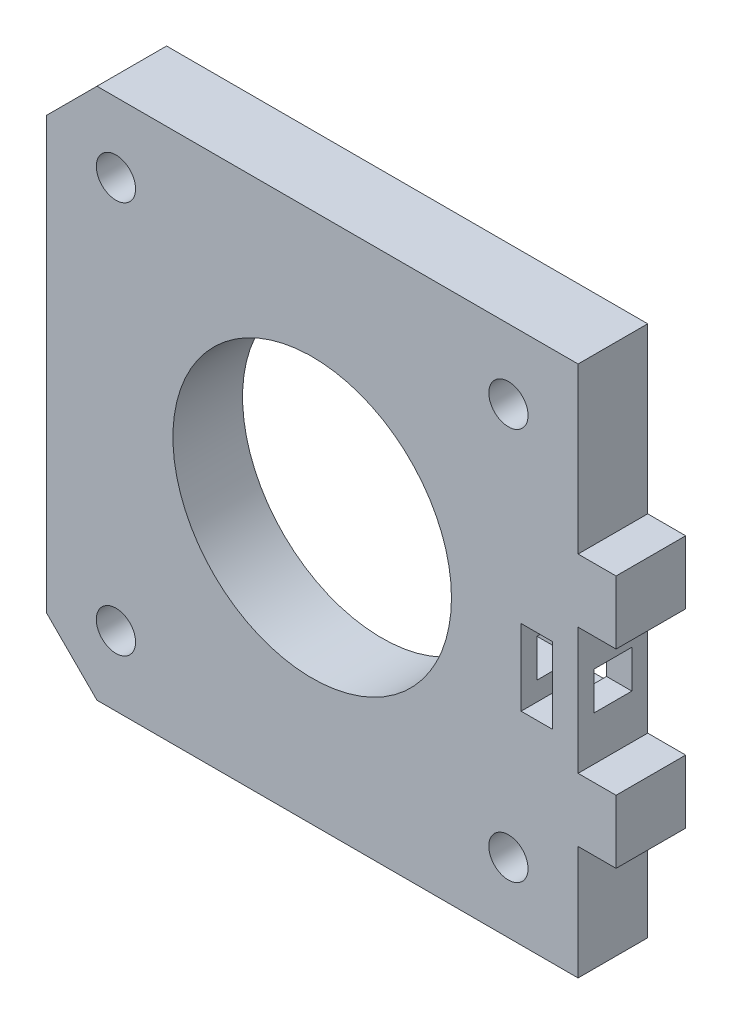
ISO-10303-21;
HEADER;
FILE_DESCRIPTION(('STEP AP214'),'2;1');
FILE_NAME('part.step','',(''),(''),'','','');
FILE_SCHEMA(('AUTOMOTIVE_DESIGN { 1 0 10303 214 1 1 1 1 }'));
ENDSEC;
DATA;
#1=APPLICATION_CONTEXT('core data for automotive mechanical design processes');
#2=APPLICATION_PROTOCOL_DEFINITION('international standard','automotive_design',2000,#1);
#3=PRODUCT_CONTEXT('',#1,'mechanical');
#4=PRODUCT('Part','Part','',(#3));
#5=PRODUCT_RELATED_PRODUCT_CATEGORY('part','',(#4));
#6=PRODUCT_DEFINITION_FORMATION('','',#4);
#7=PRODUCT_DEFINITION_CONTEXT('part definition',#1,'design');
#8=PRODUCT_DEFINITION('design','',#6,#7);
#9=PRODUCT_DEFINITION_SHAPE('','',#8);
#10=(LENGTH_UNIT() NAMED_UNIT(*) SI_UNIT(.MILLI.,.METRE.));
#11=(NAMED_UNIT(*) PLANE_ANGLE_UNIT() SI_UNIT($,.RADIAN.));
#12=(NAMED_UNIT(*) SI_UNIT($,.STERADIAN.) SOLID_ANGLE_UNIT());
#13=UNCERTAINTY_MEASURE_WITH_UNIT(LENGTH_MEASURE(1.E-05),#10,'distance_accuracy_value','');
#14=(GEOMETRIC_REPRESENTATION_CONTEXT(3) GLOBAL_UNCERTAINTY_ASSIGNED_CONTEXT((#13)) GLOBAL_UNIT_ASSIGNED_CONTEXT((#10,
#11,#12)) REPRESENTATION_CONTEXT('',''));
#15=CARTESIAN_POINT('',(0.,0.,0.));
#16=DIRECTION('',(0.,0.,1.));
#17=DIRECTION('',(1.,0.,0.));
#18=AXIS2_PLACEMENT_3D('',#15,#16,#17);
#19=CARTESIAN_POINT('',(0.,0.,5.5));
#20=DIRECTION('',(0.,0.,1.));
#21=DIRECTION('',(1.,0.,0.));
#22=AXIS2_PLACEMENT_3D('',#19,#20,#21);
#23=PLANE('',#22);
#24=CARTESIAN_POINT('',(21.,21.,5.5));
#25=DIRECTION('',(0.,0.,1.));
#26=DIRECTION('',(1.,0.,0.));
#27=AXIS2_PLACEMENT_3D('',#24,#25,#26);
#28=CIRCLE('',#27,11.);
#29=CARTESIAN_POINT('',(32.,21.,5.5));
#30=VERTEX_POINT('',#29);
#31=EDGE_CURVE('E345',#30,#30,#28,.T.);
#32=ORIENTED_EDGE('',*,*,#31,.F.);
#33=EDGE_LOOP('',(#32));
#34=FACE_BOUND('',#33,.T.);
#35=CARTESIAN_POINT('',(36.5,36.5,5.5));
#36=DIRECTION('',(0.,0.,1.));
#37=DIRECTION('',(1.,0.,0.));
#38=AXIS2_PLACEMENT_3D('',#35,#36,#37);
#39=CIRCLE('',#38,1.55);
#40=CARTESIAN_POINT('',(38.05,36.5,5.5));
#41=VERTEX_POINT('',#40);
#42=EDGE_CURVE('E348',#41,#41,#39,.T.);
#43=ORIENTED_EDGE('',*,*,#42,.F.);
#44=EDGE_LOOP('',(#43));
#45=FACE_BOUND('',#44,.T.);
#46=CARTESIAN_POINT('',(36.5,5.50000000000001,5.5));
#47=DIRECTION('',(0.,0.,1.));
#48=DIRECTION('',(1.,0.,0.));
#49=AXIS2_PLACEMENT_3D('',#46,#47,#48);
#50=CIRCLE('',#49,1.55);
#51=CARTESIAN_POINT('',(38.05,5.50000000000001,5.5));
#52=VERTEX_POINT('',#51);
#53=EDGE_CURVE('E352',#52,#52,#50,.T.);
#54=ORIENTED_EDGE('',*,*,#53,.F.);
#55=EDGE_LOOP('',(#54));
#56=FACE_BOUND('',#55,.T.);
#57=CARTESIAN_POINT('',(5.5,5.50000000000001,5.5));
#58=DIRECTION('',(0.,0.,1.));
#59=DIRECTION('',(1.,0.,0.));
#60=AXIS2_PLACEMENT_3D('',#57,#58,#59);
#61=CIRCLE('',#60,1.55);
#62=CARTESIAN_POINT('',(7.05,5.50000000000001,5.5));
#63=VERTEX_POINT('',#62);
#64=EDGE_CURVE('E355',#63,#63,#61,.T.);
#65=ORIENTED_EDGE('',*,*,#64,.F.);
#66=EDGE_LOOP('',(#65));
#67=FACE_BOUND('',#66,.T.);
#68=CARTESIAN_POINT('',(5.5,36.5,5.5));
#69=DIRECTION('',(0.,0.,1.));
#70=DIRECTION('',(1.,0.,0.));
#71=AXIS2_PLACEMENT_3D('',#68,#69,#70);
#72=CIRCLE('',#71,1.55);
#73=CARTESIAN_POINT('',(7.05,36.5,5.5));
#74=VERTEX_POINT('',#73);
#75=EDGE_CURVE('E358',#74,#74,#72,.T.);
#76=ORIENTED_EDGE('',*,*,#75,.F.);
#77=EDGE_LOOP('',(#76));
#78=FACE_BOUND('',#77,.T.);
#79=DIRECTION('',(-0.707106781186548,0.707106781186548,0.));
#80=VECTOR('',#79,1.);
#81=CARTESIAN_POINT('',(2.,2.,5.5));
#82=LINE('',#81,#80);
#83=CARTESIAN_POINT('',(4.,0.,5.5));
#84=VERTEX_POINT('',#83);
#85=CARTESIAN_POINT('',(0.,4.,5.5));
#86=VERTEX_POINT('',#85);
#87=EDGE_CURVE('E361',#84,#86,#82,.T.);
#88=ORIENTED_EDGE('',*,*,#87,.F.);
#89=DIRECTION('',(-1.,0.,0.));
#90=VECTOR('',#89,1.);
#91=CARTESIAN_POINT('',(0.,0.,5.5));
#92=LINE('',#91,#90);
#93=CARTESIAN_POINT('',(42.,0.,5.5));
#94=VERTEX_POINT('',#93);
#95=EDGE_CURVE('E364',#94,#84,#92,.T.);
#96=ORIENTED_EDGE('',*,*,#95,.F.);
#97=DIRECTION('',(0.,-1.,0.));
#98=VECTOR('',#97,1.);
#99=CARTESIAN_POINT('',(42.,0.,5.5));
#100=LINE('',#99,#98);
#101=CARTESIAN_POINT('',(42.,9.00000000000001,5.5));
#102=VERTEX_POINT('',#101);
#103=EDGE_CURVE('E367',#102,#94,#100,.T.);
#104=ORIENTED_EDGE('',*,*,#103,.F.);
#105=DIRECTION('',(-1.,0.,0.));
#106=VECTOR('',#105,1.);
#107=CARTESIAN_POINT('',(45.,9.00000000000001,5.5));
#108=LINE('',#107,#106);
#109=CARTESIAN_POINT('',(45.,9.00000000000001,5.5));
#110=VERTEX_POINT('',#109);
#111=EDGE_CURVE('E315',#110,#102,#108,.T.);
#112=ORIENTED_EDGE('',*,*,#111,.F.);
#113=DIRECTION('',(0.,-1.,0.));
#114=VECTOR('',#113,1.);
#115=CARTESIAN_POINT('',(45.,9.00000000000001,5.5));
#116=LINE('',#115,#114);
#117=CARTESIAN_POINT('',(45.,14.,5.5));
#118=VERTEX_POINT('',#117);
#119=EDGE_CURVE('E295',#118,#110,#116,.T.);
#120=ORIENTED_EDGE('',*,*,#119,.F.);
#121=DIRECTION('',(-1.,0.,0.));
#122=VECTOR('',#121,1.);
#123=CARTESIAN_POINT('',(45.,14.,5.5));
#124=LINE('',#123,#122);
#125=CARTESIAN_POINT('',(42.,14.,5.5));
#126=VERTEX_POINT('',#125);
#127=EDGE_CURVE('E305',#118,#126,#124,.T.);
#128=ORIENTED_EDGE('',*,*,#127,.T.);
#129=CARTESIAN_POINT('',(42.,24.,5.5));
#130=VERTEX_POINT('',#129);
#131=EDGE_CURVE('E371',#130,#126,#100,.T.);
#132=ORIENTED_EDGE('',*,*,#131,.F.);
#133=DIRECTION('',(-1.,0.,0.));
#134=VECTOR('',#133,1.);
#135=CARTESIAN_POINT('',(45.,24.,5.5));
#136=LINE('',#135,#134);
#137=CARTESIAN_POINT('',(45.,24.,5.5));
#138=VERTEX_POINT('',#137);
#139=EDGE_CURVE('E341',#138,#130,#136,.T.);
#140=ORIENTED_EDGE('',*,*,#139,.F.);
#141=DIRECTION('',(0.,-1.,0.));
#142=VECTOR('',#141,1.);
#143=CARTESIAN_POINT('',(45.,24.,5.5));
#144=LINE('',#143,#142);
#145=CARTESIAN_POINT('',(45.,29.,5.5));
#146=VERTEX_POINT('',#145);
#147=EDGE_CURVE('E318',#146,#138,#144,.T.);
#148=ORIENTED_EDGE('',*,*,#147,.F.);
#149=DIRECTION('',(-1.,0.,0.));
#150=VECTOR('',#149,1.);
#151=CARTESIAN_POINT('',(45.,29.,5.5));
#152=LINE('',#151,#150);
#153=CARTESIAN_POINT('',(42.,29.,5.5));
#154=VERTEX_POINT('',#153);
#155=EDGE_CURVE('E328',#146,#154,#152,.T.);
#156=ORIENTED_EDGE('',*,*,#155,.T.);
#157=CARTESIAN_POINT('',(42.,42.,5.5));
#158=VERTEX_POINT('',#157);
#159=EDGE_CURVE('E368',#158,#154,#100,.T.);
#160=ORIENTED_EDGE('',*,*,#159,.F.);
#161=DIRECTION('',(1.,0.,0.));
#162=VECTOR('',#161,1.);
#163=CARTESIAN_POINT('',(0.,42.,5.5));
#164=LINE('',#163,#162);
#165=CARTESIAN_POINT('',(4.,42.,5.5));
#166=VERTEX_POINT('',#165);
#167=EDGE_CURVE('E370',#166,#158,#164,.T.);
#168=ORIENTED_EDGE('',*,*,#167,.F.);
#169=DIRECTION('',(0.707106781186548,0.707106781186547,0.));
#170=VECTOR('',#169,1.);
#171=CARTESIAN_POINT('',(-19.,19.,5.5));
#172=LINE('',#171,#170);
#173=CARTESIAN_POINT('',(0.,38.,5.5));
#174=VERTEX_POINT('',#173);
#175=EDGE_CURVE('E374',#174,#166,#172,.T.);
#176=ORIENTED_EDGE('',*,*,#175,.F.);
#177=DIRECTION('',(0.,1.,0.));
#178=VECTOR('',#177,1.);
#179=CARTESIAN_POINT('',(0.,0.,5.5));
#180=LINE('',#179,#178);
#181=EDGE_CURVE('E377',#86,#174,#180,.T.);
#182=ORIENTED_EDGE('',*,*,#181,.F.);
#183=EDGE_LOOP('',(#88,#96,#104,#112,#120,#128,#132,#140,#148,#156,#160,#168,#176,#182));
#184=FACE_BOUND('',#183,.T.);
#185=DIRECTION('',(-1.,0.,0.));
#186=VECTOR('',#185,1.);
#187=CARTESIAN_POINT('',(0.,16.0000000000001,5.5));
#188=LINE('',#187,#186);
#189=CARTESIAN_POINT('',(40.,16.,5.5));
#190=VERTEX_POINT('',#189);
#191=CARTESIAN_POINT('',(37.5,16.,5.5));
#192=VERTEX_POINT('',#191);
#193=EDGE_CURVE('E233',#190,#192,#188,.T.);
#194=ORIENTED_EDGE('',*,*,#193,.T.);
#195=DIRECTION('',(0.,1.,0.));
#196=VECTOR('',#195,1.);
#197=CARTESIAN_POINT('',(37.5,0.,5.5));
#198=LINE('',#197,#196);
#199=CARTESIAN_POINT('',(37.5,22.,5.5));
#200=VERTEX_POINT('',#199);
#201=EDGE_CURVE('E50',#192,#200,#198,.T.);
#202=ORIENTED_EDGE('',*,*,#201,.T.);
#203=DIRECTION('',(1.,0.,0.));
#204=VECTOR('',#203,1.);
#205=CARTESIAN_POINT('',(0.,22.,5.5));
#206=LINE('',#205,#204);
#207=CARTESIAN_POINT('',(40.,22.,5.5));
#208=VERTEX_POINT('',#207);
#209=EDGE_CURVE('E224',#200,#208,#206,.T.);
#210=ORIENTED_EDGE('',*,*,#209,.T.);
#211=DIRECTION('',(0.,-1.,0.));
#212=VECTOR('',#211,1.);
#213=CARTESIAN_POINT('',(40.,0.,5.5));
#214=LINE('',#213,#212);
#215=EDGE_CURVE('E227',#208,#190,#214,.T.);
#216=ORIENTED_EDGE('',*,*,#215,.T.);
#217=EDGE_LOOP('',(#194,#202,#210,#216));
#218=FACE_BOUND('',#217,.T.);
#219=ADVANCED_FACE('F35',(#34,#45,#56,#67,#78,#184,#218),#23,.T.);
#220=CARTESIAN_POINT('',(0.,0.,0.));
#221=DIRECTION('',(0.,0.,1.));
#222=DIRECTION('',(1.,0.,0.));
#223=AXIS2_PLACEMENT_3D('',#220,#221,#222);
#224=PLANE('',#223);
#225=DIRECTION('',(-0.707106781186548,0.707106781186548,0.));
#226=VECTOR('',#225,1.);
#227=CARTESIAN_POINT('',(2.,2.,0.));
#228=LINE('',#227,#226);
#229=CARTESIAN_POINT('',(4.,0.,0.));
#230=VERTEX_POINT('',#229);
#231=CARTESIAN_POINT('',(0.,4.,0.));
#232=VERTEX_POINT('',#231);
#233=EDGE_CURVE('E395',#230,#232,#228,.T.);
#234=ORIENTED_EDGE('',*,*,#233,.T.);
#235=DIRECTION('',(0.,1.,0.));
#236=VECTOR('',#235,1.);
#237=CARTESIAN_POINT('',(0.,0.,0.));
#238=LINE('',#237,#236);
#239=CARTESIAN_POINT('',(0.,38.,0.));
#240=VERTEX_POINT('',#239);
#241=EDGE_CURVE('E349',#232,#240,#238,.T.);
#242=ORIENTED_EDGE('',*,*,#241,.T.);
#243=DIRECTION('',(0.707106781186548,0.707106781186547,0.));
#244=VECTOR('',#243,1.);
#245=CARTESIAN_POINT('',(-19.,19.,0.));
#246=LINE('',#245,#244);
#247=CARTESIAN_POINT('',(4.,42.,0.));
#248=VERTEX_POINT('',#247);
#249=EDGE_CURVE('E409',#240,#248,#246,.T.);
#250=ORIENTED_EDGE('',*,*,#249,.T.);
#251=DIRECTION('',(1.,0.,0.));
#252=VECTOR('',#251,1.);
#253=CARTESIAN_POINT('',(0.,42.,0.));
#254=LINE('',#253,#252);
#255=CARTESIAN_POINT('',(42.,42.,0.));
#256=VERTEX_POINT('',#255);
#257=EDGE_CURVE('E405',#248,#256,#254,.T.);
#258=ORIENTED_EDGE('',*,*,#257,.T.);
#259=DIRECTION('',(0.,-1.,0.));
#260=VECTOR('',#259,1.);
#261=CARTESIAN_POINT('',(42.,0.,0.));
#262=LINE('',#261,#260);
#263=CARTESIAN_POINT('',(42.,29.,0.));
#264=VERTEX_POINT('',#263);
#265=EDGE_CURVE('E402',#256,#264,#262,.T.);
#266=ORIENTED_EDGE('',*,*,#265,.T.);
#267=DIRECTION('',(-1.,0.,0.));
#268=VECTOR('',#267,1.);
#269=CARTESIAN_POINT('',(45.,29.,0.));
#270=LINE('',#269,#268);
#271=CARTESIAN_POINT('',(45.,29.,0.));
#272=VERTEX_POINT('',#271);
#273=EDGE_CURVE('E335',#272,#264,#270,.T.);
#274=ORIENTED_EDGE('',*,*,#273,.F.);
#275=DIRECTION('',(0.,1.,0.));
#276=VECTOR('',#275,1.);
#277=CARTESIAN_POINT('',(45.,29.,0.));
#278=LINE('',#277,#276);
#279=CARTESIAN_POINT('',(45.,24.,0.));
#280=VERTEX_POINT('',#279);
#281=EDGE_CURVE('E324',#280,#272,#278,.T.);
#282=ORIENTED_EDGE('',*,*,#281,.F.);
#283=DIRECTION('',(-1.,0.,0.));
#284=VECTOR('',#283,1.);
#285=CARTESIAN_POINT('',(45.,24.,0.));
#286=LINE('',#285,#284);
#287=CARTESIAN_POINT('',(42.,24.,0.));
#288=VERTEX_POINT('',#287);
#289=EDGE_CURVE('E338',#280,#288,#286,.T.);
#290=ORIENTED_EDGE('',*,*,#289,.T.);
#291=CARTESIAN_POINT('',(42.,14.,0.));
#292=VERTEX_POINT('',#291);
#293=EDGE_CURVE('E406',#288,#292,#262,.T.);
#294=ORIENTED_EDGE('',*,*,#293,.T.);
#295=DIRECTION('',(-1.,0.,0.));
#296=VECTOR('',#295,1.);
#297=CARTESIAN_POINT('',(45.,14.,0.));
#298=LINE('',#297,#296);
#299=CARTESIAN_POINT('',(45.,14.,0.));
#300=VERTEX_POINT('',#299);
#301=EDGE_CURVE('E311',#300,#292,#298,.T.);
#302=ORIENTED_EDGE('',*,*,#301,.F.);
#303=DIRECTION('',(0.,1.,0.));
#304=VECTOR('',#303,1.);
#305=CARTESIAN_POINT('',(45.,14.,0.));
#306=LINE('',#305,#304);
#307=CARTESIAN_POINT('',(45.,9.00000000000001,0.));
#308=VERTEX_POINT('',#307);
#309=EDGE_CURVE('E301',#308,#300,#306,.T.);
#310=ORIENTED_EDGE('',*,*,#309,.F.);
#311=DIRECTION('',(-1.,0.,0.));
#312=VECTOR('',#311,1.);
#313=CARTESIAN_POINT('',(45.,9.00000000000001,0.));
#314=LINE('',#313,#312);
#315=CARTESIAN_POINT('',(42.,9.00000000000001,0.));
#316=VERTEX_POINT('',#315);
#317=EDGE_CURVE('E313',#308,#316,#314,.T.);
#318=ORIENTED_EDGE('',*,*,#317,.T.);
#319=CARTESIAN_POINT('',(42.,0.,0.));
#320=VERTEX_POINT('',#319);
#321=EDGE_CURVE('E401',#316,#320,#262,.T.);
#322=ORIENTED_EDGE('',*,*,#321,.T.);
#323=DIRECTION('',(-1.,0.,0.));
#324=VECTOR('',#323,1.);
#325=CARTESIAN_POINT('',(0.,0.,0.));
#326=LINE('',#325,#324);
#327=EDGE_CURVE('E398',#320,#230,#326,.T.);
#328=ORIENTED_EDGE('',*,*,#327,.T.);
#329=EDGE_LOOP('',(#234,#242,#250,#258,#266,#274,#282,#290,#294,#302,#310,#318,#322,#328));
#330=FACE_BOUND('',#329,.T.);
#331=CARTESIAN_POINT('',(5.5,36.5,0.));
#332=DIRECTION('',(0.,0.,1.));
#333=DIRECTION('',(1.,0.,0.));
#334=AXIS2_PLACEMENT_3D('',#331,#332,#333);
#335=CIRCLE('',#334,1.55);
#336=CARTESIAN_POINT('',(7.05,36.5,0.));
#337=VERTEX_POINT('',#336);
#338=EDGE_CURVE('E392',#337,#337,#335,.T.);
#339=ORIENTED_EDGE('',*,*,#338,.T.);
#340=EDGE_LOOP('',(#339));
#341=FACE_BOUND('',#340,.T.);
#342=CARTESIAN_POINT('',(5.5,5.50000000000001,0.));
#343=DIRECTION('',(0.,0.,1.));
#344=DIRECTION('',(1.,0.,0.));
#345=AXIS2_PLACEMENT_3D('',#342,#343,#344);
#346=CIRCLE('',#345,1.55);
#347=CARTESIAN_POINT('',(7.05,5.50000000000001,0.));
#348=VERTEX_POINT('',#347);
#349=EDGE_CURVE('E389',#348,#348,#346,.T.);
#350=ORIENTED_EDGE('',*,*,#349,.T.);
#351=EDGE_LOOP('',(#350));
#352=FACE_BOUND('',#351,.T.);
#353=CARTESIAN_POINT('',(36.5,5.50000000000001,0.));
#354=DIRECTION('',(0.,0.,1.));
#355=DIRECTION('',(1.,0.,0.));
#356=AXIS2_PLACEMENT_3D('',#353,#354,#355);
#357=CIRCLE('',#356,1.55);
#358=CARTESIAN_POINT('',(38.05,5.50000000000001,0.));
#359=VERTEX_POINT('',#358);
#360=EDGE_CURVE('E386',#359,#359,#357,.T.);
#361=ORIENTED_EDGE('',*,*,#360,.T.);
#362=EDGE_LOOP('',(#361));
#363=FACE_BOUND('',#362,.T.);
#364=CARTESIAN_POINT('',(36.5,36.5,0.));
#365=DIRECTION('',(0.,0.,1.));
#366=DIRECTION('',(1.,0.,0.));
#367=AXIS2_PLACEMENT_3D('',#364,#365,#366);
#368=CIRCLE('',#367,1.55);
#369=CARTESIAN_POINT('',(38.05,36.5,0.));
#370=VERTEX_POINT('',#369);
#371=EDGE_CURVE('E383',#370,#370,#368,.T.);
#372=ORIENTED_EDGE('',*,*,#371,.T.);
#373=EDGE_LOOP('',(#372));
#374=FACE_BOUND('',#373,.T.);
#375=CARTESIAN_POINT('',(21.,21.,0.));
#376=DIRECTION('',(0.,0.,1.));
#377=DIRECTION('',(1.,0.,0.));
#378=AXIS2_PLACEMENT_3D('',#375,#376,#377);
#379=CIRCLE('',#378,11.);
#380=CARTESIAN_POINT('',(32.,21.,0.));
#381=VERTEX_POINT('',#380);
#382=EDGE_CURVE('E344',#381,#381,#379,.T.);
#383=ORIENTED_EDGE('',*,*,#382,.T.);
#384=EDGE_LOOP('',(#383));
#385=FACE_BOUND('',#384,.T.);
#386=DIRECTION('',(0.,1.,0.));
#387=VECTOR('',#386,1.);
#388=CARTESIAN_POINT('',(37.5,0.,0.));
#389=LINE('',#388,#387);
#390=CARTESIAN_POINT('',(37.5,16.,0.));
#391=VERTEX_POINT('',#390);
#392=CARTESIAN_POINT('',(37.5,22.,0.));
#393=VERTEX_POINT('',#392);
#394=EDGE_CURVE('E215',#391,#393,#389,.T.);
#395=ORIENTED_EDGE('',*,*,#394,.F.);
#396=DIRECTION('',(-1.,0.,0.));
#397=VECTOR('',#396,1.);
#398=CARTESIAN_POINT('',(0.,16.0000000000001,0.));
#399=LINE('',#398,#397);
#400=CARTESIAN_POINT('',(40.,16.,0.));
#401=VERTEX_POINT('',#400);
#402=EDGE_CURVE('E207',#401,#391,#399,.T.);
#403=ORIENTED_EDGE('',*,*,#402,.F.);
#404=DIRECTION('',(0.,-1.,0.));
#405=VECTOR('',#404,1.);
#406=CARTESIAN_POINT('',(40.,0.,0.));
#407=LINE('',#406,#405);
#408=CARTESIAN_POINT('',(40.,22.,0.));
#409=VERTEX_POINT('',#408);
#410=EDGE_CURVE('E214',#409,#401,#407,.T.);
#411=ORIENTED_EDGE('',*,*,#410,.F.);
#412=DIRECTION('',(1.,0.,0.));
#413=VECTOR('',#412,1.);
#414=CARTESIAN_POINT('',(0.,22.,0.));
#415=LINE('',#414,#413);
#416=EDGE_CURVE('E220',#393,#409,#415,.T.);
#417=ORIENTED_EDGE('',*,*,#416,.F.);
#418=EDGE_LOOP('',(#395,#403,#411,#417));
#419=FACE_BOUND('',#418,.T.);
#420=ADVANCED_FACE('F223',(#330,#341,#352,#363,#374,#385,#419),#224,.F.);
#421=CARTESIAN_POINT('',(34.,20.5,1.25));
#422=DIRECTION('',(0.,0.,-1.));
#423=DIRECTION('',(0.,1.,0.));
#424=AXIS2_PLACEMENT_3D('',#421,#422,#423);
#425=PLANE('',#424);
#426=DIRECTION('',(0.,1.,0.));
#427=VECTOR('',#426,1.);
#428=CARTESIAN_POINT('',(40.,20.5,1.25));
#429=LINE('',#428,#427);
#430=CARTESIAN_POINT('',(40.,17.5,1.25));
#431=VERTEX_POINT('',#430);
#432=CARTESIAN_POINT('',(40.,20.5,1.25));
#433=VERTEX_POINT('',#432);
#434=EDGE_CURVE('E246',#431,#433,#429,.T.);
#435=ORIENTED_EDGE('',*,*,#434,.F.);
#436=DIRECTION('',(1.,0.,0.));
#437=VECTOR('',#436,1.);
#438=CARTESIAN_POINT('',(34.,17.5,1.25));
#439=LINE('',#438,#437);
#440=CARTESIAN_POINT('',(42.,17.5,1.25));
#441=VERTEX_POINT('',#440);
#442=EDGE_CURVE('E283',#431,#441,#439,.T.);
#443=ORIENTED_EDGE('',*,*,#442,.T.);
#444=DIRECTION('',(0.,1.,0.));
#445=VECTOR('',#444,1.);
#446=CARTESIAN_POINT('',(42.,20.5,1.25));
#447=LINE('',#446,#445);
#448=CARTESIAN_POINT('',(42.,20.5,1.25));
#449=VERTEX_POINT('',#448);
#450=EDGE_CURVE('E254',#441,#449,#447,.T.);
#451=ORIENTED_EDGE('',*,*,#450,.T.);
#452=DIRECTION('',(1.,0.,0.));
#453=VECTOR('',#452,1.);
#454=CARTESIAN_POINT('',(34.,20.5,1.25));
#455=LINE('',#454,#453);
#456=EDGE_CURVE('E268',#433,#449,#455,.T.);
#457=ORIENTED_EDGE('',*,*,#456,.F.);
#458=EDGE_LOOP('',(#435,#443,#451,#457));
#459=FACE_BOUND('',#458,.T.);
#460=ADVANCED_FACE('F449',(#459),#425,.F.);
#461=CARTESIAN_POINT('',(34.,17.5,4.25));
#462=DIRECTION('',(0.,-1.,0.));
#463=DIRECTION('',(1.,0.,0.));
#464=AXIS2_PLACEMENT_3D('',#461,#462,#463);
#465=PLANE('',#464);
#466=DIRECTION('',(0.,0.,-1.));
#467=VECTOR('',#466,1.);
#468=CARTESIAN_POINT('',(40.,17.5,4.25));
#469=LINE('',#468,#467);
#470=CARTESIAN_POINT('',(40.,17.5,4.25));
#471=VERTEX_POINT('',#470);
#472=EDGE_CURVE('E244',#471,#431,#469,.T.);
#473=ORIENTED_EDGE('',*,*,#472,.F.);
#474=DIRECTION('',(1.,0.,0.));
#475=VECTOR('',#474,1.);
#476=CARTESIAN_POINT('',(34.,17.5,4.25));
#477=LINE('',#476,#475);
#478=CARTESIAN_POINT('',(42.,17.5,4.25));
#479=VERTEX_POINT('',#478);
#480=EDGE_CURVE('E287',#471,#479,#477,.T.);
#481=ORIENTED_EDGE('',*,*,#480,.T.);
#482=DIRECTION('',(0.,0.,-1.));
#483=VECTOR('',#482,1.);
#484=CARTESIAN_POINT('',(42.,17.5,4.25));
#485=LINE('',#484,#483);
#486=EDGE_CURVE('E259',#479,#441,#485,.T.);
#487=ORIENTED_EDGE('',*,*,#486,.T.);
#488=ORIENTED_EDGE('',*,*,#442,.F.);
#489=EDGE_LOOP('',(#473,#481,#487,#488));
#490=FACE_BOUND('',#489,.T.);
#491=ADVANCED_FACE('F447',(#490),#465,.F.);
#492=CARTESIAN_POINT('',(34.,20.5,4.25));
#493=DIRECTION('',(0.,0.,1.));
#494=DIRECTION('',(1.,0.,0.));
#495=AXIS2_PLACEMENT_3D('',#492,#493,#494);
#496=PLANE('',#495);
#497=DIRECTION('',(0.,-1.,0.));
#498=VECTOR('',#497,1.);
#499=CARTESIAN_POINT('',(40.,20.5,4.25));
#500=LINE('',#499,#498);
#501=CARTESIAN_POINT('',(40.,20.5,4.25));
#502=VERTEX_POINT('',#501);
#503=EDGE_CURVE('E239',#502,#471,#500,.T.);
#504=ORIENTED_EDGE('',*,*,#503,.F.);
#505=DIRECTION('',(1.,0.,0.));
#506=VECTOR('',#505,1.);
#507=CARTESIAN_POINT('',(34.,20.5,4.25));
#508=LINE('',#507,#506);
#509=CARTESIAN_POINT('',(42.,20.5,4.25));
#510=VERTEX_POINT('',#509);
#511=EDGE_CURVE('E291',#502,#510,#508,.T.);
#512=ORIENTED_EDGE('',*,*,#511,.T.);
#513=DIRECTION('',(0.,-1.,0.));
#514=VECTOR('',#513,1.);
#515=CARTESIAN_POINT('',(42.,20.5,4.25));
#516=LINE('',#515,#514);
#517=EDGE_CURVE('E274',#510,#479,#516,.T.);
#518=ORIENTED_EDGE('',*,*,#517,.T.);
#519=ORIENTED_EDGE('',*,*,#480,.F.);
#520=EDGE_LOOP('',(#504,#512,#518,#519));
#521=FACE_BOUND('',#520,.T.);
#522=ADVANCED_FACE('F436',(#521),#496,.F.);
#523=CARTESIAN_POINT('',(34.,20.5,4.25));
#524=DIRECTION('',(0.,1.,0.));
#525=DIRECTION('',(-1.,0.,0.));
#526=AXIS2_PLACEMENT_3D('',#523,#524,#525);
#527=PLANE('',#526);
#528=DIRECTION('',(0.,0.,1.));
#529=VECTOR('',#528,1.);
#530=CARTESIAN_POINT('',(40.,20.5,4.25));
#531=LINE('',#530,#529);
#532=EDGE_CURVE('E43',#433,#502,#531,.T.);
#533=ORIENTED_EDGE('',*,*,#532,.F.);
#534=ORIENTED_EDGE('',*,*,#456,.T.);
#535=DIRECTION('',(0.,0.,1.));
#536=VECTOR('',#535,1.);
#537=CARTESIAN_POINT('',(42.,20.5,4.25));
#538=LINE('',#537,#536);
#539=EDGE_CURVE('E271',#449,#510,#538,.T.);
#540=ORIENTED_EDGE('',*,*,#539,.T.);
#541=ORIENTED_EDGE('',*,*,#511,.F.);
#542=EDGE_LOOP('',(#533,#534,#540,#541));
#543=FACE_BOUND('',#542,.T.);
#544=ADVANCED_FACE('F437',(#543),#527,.F.);
#545=CARTESIAN_POINT('',(42.,0.,5.5));
#546=DIRECTION('',(1.,0.,0.));
#547=DIRECTION('',(0.,1.,0.));
#548=AXIS2_PLACEMENT_3D('',#545,#546,#547);
#549=PLANE('',#548);
#550=ORIENTED_EDGE('',*,*,#321,.F.);
#551=DIRECTION('',(0.,0.,-1.));
#552=VECTOR('',#551,1.);
#553=CARTESIAN_POINT('',(42.,9.00000000000001,0.));
#554=LINE('',#553,#552);
#555=EDGE_CURVE('E282',#102,#316,#554,.T.);
#556=ORIENTED_EDGE('',*,*,#555,.F.);
#557=ORIENTED_EDGE('',*,*,#103,.T.);
#558=DIRECTION('',(0.,0.,-1.));
#559=VECTOR('',#558,1.);
#560=CARTESIAN_POINT('',(42.,0.,5.5));
#561=LINE('',#560,#559);
#562=EDGE_CURVE('E421',#94,#320,#561,.T.);
#563=ORIENTED_EDGE('',*,*,#562,.T.);
#564=EDGE_LOOP('',(#550,#556,#557,#563));
#565=FACE_BOUND('',#564,.T.);
#566=ADVANCED_FACE('F490',(#565),#549,.T.);
#567=ORIENTED_EDGE('',*,*,#450,.F.);
#568=ORIENTED_EDGE('',*,*,#486,.F.);
#569=ORIENTED_EDGE('',*,*,#517,.F.);
#570=ORIENTED_EDGE('',*,*,#539,.F.);
#571=EDGE_LOOP('',(#567,#568,#569,#570));
#572=FACE_BOUND('',#571,.T.);
#573=ORIENTED_EDGE('',*,*,#131,.T.);
#574=DIRECTION('',(0.,0.,1.));
#575=VECTOR('',#574,1.);
#576=CARTESIAN_POINT('',(42.,14.,5.5));
#577=LINE('',#576,#575);
#578=EDGE_CURVE('E299',#292,#126,#577,.T.);
#579=ORIENTED_EDGE('',*,*,#578,.F.);
#580=ORIENTED_EDGE('',*,*,#293,.F.);
#581=DIRECTION('',(0.,0.,-1.));
#582=VECTOR('',#581,1.);
#583=CARTESIAN_POINT('',(42.,24.,0.));
#584=LINE('',#583,#582);
#585=EDGE_CURVE('E317',#130,#288,#584,.T.);
#586=ORIENTED_EDGE('',*,*,#585,.F.);
#587=EDGE_LOOP('',(#573,#579,#580,#586));
#588=FACE_BOUND('',#587,.T.);
#589=ADVANCED_FACE('F443',(#572,#588),#549,.T.);
#590=DIRECTION('',(0.,0.,1.));
#591=VECTOR('',#590,1.);
#592=CARTESIAN_POINT('',(42.,29.,5.5));
#593=LINE('',#592,#591);
#594=EDGE_CURVE('E322',#264,#154,#593,.T.);
#595=ORIENTED_EDGE('',*,*,#594,.F.);
#596=ORIENTED_EDGE('',*,*,#265,.F.);
#597=DIRECTION('',(0.,0.,-1.));
#598=VECTOR('',#597,1.);
#599=CARTESIAN_POINT('',(42.,42.,5.5));
#600=LINE('',#599,#598);
#601=EDGE_CURVE('E419',#158,#256,#600,.T.);
#602=ORIENTED_EDGE('',*,*,#601,.F.);
#603=ORIENTED_EDGE('',*,*,#159,.T.);
#604=EDGE_LOOP('',(#595,#596,#602,#603));
#605=FACE_BOUND('',#604,.T.);
#606=ADVANCED_FACE('F494',(#605),#549,.T.);
#607=CARTESIAN_POINT('',(2.,2.,5.5));
#608=DIRECTION('',(-0.707106781186548,-0.707106781186548,0.));
#609=DIRECTION('',(0.707106781186548,-0.707106781186548,0.));
#610=AXIS2_PLACEMENT_3D('',#607,#608,#609);
#611=PLANE('',#610);
#612=ORIENTED_EDGE('',*,*,#233,.F.);
#613=DIRECTION('',(0.,0.,-1.));
#614=VECTOR('',#613,1.);
#615=CARTESIAN_POINT('',(4.,0.,5.5));
#616=LINE('',#615,#614);
#617=EDGE_CURVE('E424',#84,#230,#616,.T.);
#618=ORIENTED_EDGE('',*,*,#617,.F.);
#619=ORIENTED_EDGE('',*,*,#87,.T.);
#620=DIRECTION('',(0.,0.,-1.));
#621=VECTOR('',#620,1.);
#622=CARTESIAN_POINT('',(0.,4.,5.5));
#623=LINE('',#622,#621);
#624=EDGE_CURVE('E380',#86,#232,#623,.T.);
#625=ORIENTED_EDGE('',*,*,#624,.T.);
#626=EDGE_LOOP('',(#612,#618,#619,#625));
#627=FACE_BOUND('',#626,.T.);
#628=ADVANCED_FACE('F497',(#627),#611,.T.);
#629=CARTESIAN_POINT('',(0.,0.,5.5));
#630=DIRECTION('',(0.,-1.,0.));
#631=DIRECTION('',(1.,0.,0.));
#632=AXIS2_PLACEMENT_3D('',#629,#630,#631);
#633=PLANE('',#632);
#634=ORIENTED_EDGE('',*,*,#327,.F.);
#635=ORIENTED_EDGE('',*,*,#562,.F.);
#636=ORIENTED_EDGE('',*,*,#95,.T.);
#637=ORIENTED_EDGE('',*,*,#617,.T.);
#638=EDGE_LOOP('',(#634,#635,#636,#637));
#639=FACE_BOUND('',#638,.T.);
#640=ADVANCED_FACE('F488',(#639),#633,.T.);
#641=CARTESIAN_POINT('',(0.,42.,5.5));
#642=DIRECTION('',(0.,1.,0.));
#643=DIRECTION('',(-1.,0.,0.));
#644=AXIS2_PLACEMENT_3D('',#641,#642,#643);
#645=PLANE('',#644);
#646=ORIENTED_EDGE('',*,*,#257,.F.);
#647=DIRECTION('',(0.,0.,-1.));
#648=VECTOR('',#647,1.);
#649=CARTESIAN_POINT('',(4.,42.,5.5));
#650=LINE('',#649,#648);
#651=EDGE_CURVE('E417',#166,#248,#650,.T.);
#652=ORIENTED_EDGE('',*,*,#651,.F.);
#653=ORIENTED_EDGE('',*,*,#167,.T.);
#654=ORIENTED_EDGE('',*,*,#601,.T.);
#655=EDGE_LOOP('',(#646,#652,#653,#654));
#656=FACE_BOUND('',#655,.T.);
#657=ADVANCED_FACE('F484',(#656),#645,.T.);
#658=CARTESIAN_POINT('',(-19.,19.,5.5));
#659=DIRECTION('',(-0.707106781186547,0.707106781186548,0.));
#660=DIRECTION('',(-0.707106781186548,-0.707106781186547,0.));
#661=AXIS2_PLACEMENT_3D('',#658,#659,#660);
#662=PLANE('',#661);
#663=ORIENTED_EDGE('',*,*,#249,.F.);
#664=DIRECTION('',(0.,0.,-1.));
#665=VECTOR('',#664,1.);
#666=CARTESIAN_POINT('',(0.,38.,5.5));
#667=LINE('',#666,#665);
#668=EDGE_CURVE('E415',#174,#240,#667,.T.);
#669=ORIENTED_EDGE('',*,*,#668,.F.);
#670=ORIENTED_EDGE('',*,*,#175,.T.);
#671=ORIENTED_EDGE('',*,*,#651,.T.);
#672=EDGE_LOOP('',(#663,#669,#670,#671));
#673=FACE_BOUND('',#672,.T.);
#674=ADVANCED_FACE('F480',(#673),#662,.T.);
#675=CARTESIAN_POINT('',(5.5,36.5,5.5));
#676=DIRECTION('',(0.,0.,-1.));
#677=DIRECTION('',(-1.,0.,0.));
#678=AXIS2_PLACEMENT_3D('',#675,#676,#677);
#679=CYLINDRICAL_SURFACE('',#678,1.55);
#680=ORIENTED_EDGE('',*,*,#75,.T.);
#681=EDGE_LOOP('',(#680));
#682=FACE_BOUND('',#681,.T.);
#683=ORIENTED_EDGE('',*,*,#338,.F.);
#684=EDGE_LOOP('',(#683));
#685=FACE_BOUND('',#684,.T.);
#686=ADVANCED_FACE('F483',(#682,#685),#679,.F.);
#687=CARTESIAN_POINT('',(5.5,5.50000000000001,5.5));
#688=DIRECTION('',(0.,0.,-1.));
#689=DIRECTION('',(-1.,0.,0.));
#690=AXIS2_PLACEMENT_3D('',#687,#688,#689);
#691=CYLINDRICAL_SURFACE('',#690,1.55);
#692=ORIENTED_EDGE('',*,*,#64,.T.);
#693=EDGE_LOOP('',(#692));
#694=FACE_BOUND('',#693,.T.);
#695=ORIENTED_EDGE('',*,*,#349,.F.);
#696=EDGE_LOOP('',(#695));
#697=FACE_BOUND('',#696,.T.);
#698=ADVANCED_FACE('F504',(#694,#697),#691,.F.);
#699=CARTESIAN_POINT('',(36.5,5.50000000000001,5.5));
#700=DIRECTION('',(0.,0.,-1.));
#701=DIRECTION('',(-1.,0.,0.));
#702=AXIS2_PLACEMENT_3D('',#699,#700,#701);
#703=CYLINDRICAL_SURFACE('',#702,1.55);
#704=ORIENTED_EDGE('',*,*,#53,.T.);
#705=EDGE_LOOP('',(#704));
#706=FACE_BOUND('',#705,.T.);
#707=ORIENTED_EDGE('',*,*,#360,.F.);
#708=EDGE_LOOP('',(#707));
#709=FACE_BOUND('',#708,.T.);
#710=ADVANCED_FACE('F508',(#706,#709),#703,.F.);
#711=CARTESIAN_POINT('',(36.5,36.5,5.5));
#712=DIRECTION('',(0.,0.,-1.));
#713=DIRECTION('',(-1.,0.,0.));
#714=AXIS2_PLACEMENT_3D('',#711,#712,#713);
#715=CYLINDRICAL_SURFACE('',#714,1.55);
#716=ORIENTED_EDGE('',*,*,#42,.T.);
#717=EDGE_LOOP('',(#716));
#718=FACE_BOUND('',#717,.T.);
#719=ORIENTED_EDGE('',*,*,#371,.F.);
#720=EDGE_LOOP('',(#719));
#721=FACE_BOUND('',#720,.T.);
#722=ADVANCED_FACE('F511',(#718,#721),#715,.F.);
#723=CARTESIAN_POINT('',(21.,21.,5.5));
#724=DIRECTION('',(0.,0.,-1.));
#725=DIRECTION('',(-1.,0.,0.));
#726=AXIS2_PLACEMENT_3D('',#723,#724,#725);
#727=CYLINDRICAL_SURFACE('',#726,11.);
#728=ORIENTED_EDGE('',*,*,#31,.T.);
#729=EDGE_LOOP('',(#728));
#730=FACE_BOUND('',#729,.T.);
#731=ORIENTED_EDGE('',*,*,#382,.F.);
#732=EDGE_LOOP('',(#731));
#733=FACE_BOUND('',#732,.T.);
#734=ADVANCED_FACE('F37',(#730,#733),#727,.F.);
#735=CARTESIAN_POINT('',(0.,0.,5.5));
#736=DIRECTION('',(-1.,0.,0.));
#737=DIRECTION('',(0.,0.,1.));
#738=AXIS2_PLACEMENT_3D('',#735,#736,#737);
#739=PLANE('',#738);
#740=ORIENTED_EDGE('',*,*,#241,.F.);
#741=ORIENTED_EDGE('',*,*,#624,.F.);
#742=ORIENTED_EDGE('',*,*,#181,.T.);
#743=ORIENTED_EDGE('',*,*,#668,.T.);
#744=EDGE_LOOP('',(#740,#741,#742,#743));
#745=FACE_BOUND('',#744,.T.);
#746=ADVANCED_FACE('F476',(#745),#739,.T.);
#747=CARTESIAN_POINT('',(45.,24.,0.));
#748=DIRECTION('',(0.,1.,0.));
#749=DIRECTION('',(-1.,0.,0.));
#750=AXIS2_PLACEMENT_3D('',#747,#748,#749);
#751=PLANE('',#750);
#752=ORIENTED_EDGE('',*,*,#585,.T.);
#753=ORIENTED_EDGE('',*,*,#289,.F.);
#754=DIRECTION('',(0.,0.,-1.));
#755=VECTOR('',#754,1.);
#756=CARTESIAN_POINT('',(45.,24.,0.));
#757=LINE('',#756,#755);
#758=EDGE_CURVE('E321',#138,#280,#757,.T.);
#759=ORIENTED_EDGE('',*,*,#758,.F.);
#760=ORIENTED_EDGE('',*,*,#139,.T.);
#761=EDGE_LOOP('',(#752,#753,#759,#760));
#762=FACE_BOUND('',#761,.T.);
#763=ADVANCED_FACE('F473',(#762),#751,.F.);
#764=CARTESIAN_POINT('',(45.,29.,5.5));
#765=DIRECTION('',(0.,-1.,0.));
#766=DIRECTION('',(1.,0.,0.));
#767=AXIS2_PLACEMENT_3D('',#764,#765,#766);
#768=PLANE('',#767);
#769=ORIENTED_EDGE('',*,*,#594,.T.);
#770=ORIENTED_EDGE('',*,*,#155,.F.);
#771=DIRECTION('',(0.,0.,1.));
#772=VECTOR('',#771,1.);
#773=CARTESIAN_POINT('',(45.,29.,5.5));
#774=LINE('',#773,#772);
#775=EDGE_CURVE('E326',#272,#146,#774,.T.);
#776=ORIENTED_EDGE('',*,*,#775,.F.);
#777=ORIENTED_EDGE('',*,*,#273,.T.);
#778=EDGE_LOOP('',(#769,#770,#776,#777));
#779=FACE_BOUND('',#778,.T.);
#780=ADVANCED_FACE('F655',(#779),#768,.F.);
#781=CARTESIAN_POINT('',(45.,0.,0.));
#782=DIRECTION('',(-1.,0.,0.));
#783=DIRECTION('',(0.,0.,1.));
#784=AXIS2_PLACEMENT_3D('',#781,#782,#783);
#785=PLANE('',#784);
#786=ORIENTED_EDGE('',*,*,#147,.T.);
#787=ORIENTED_EDGE('',*,*,#758,.T.);
#788=ORIENTED_EDGE('',*,*,#281,.T.);
#789=ORIENTED_EDGE('',*,*,#775,.T.);
#790=EDGE_LOOP('',(#786,#787,#788,#789));
#791=FACE_BOUND('',#790,.T.);
#792=ADVANCED_FACE('F645',(#791),#785,.F.);
#793=CARTESIAN_POINT('',(45.,9.00000000000001,0.));
#794=DIRECTION('',(0.,1.,0.));
#795=DIRECTION('',(-1.,0.,0.));
#796=AXIS2_PLACEMENT_3D('',#793,#794,#795);
#797=PLANE('',#796);
#798=ORIENTED_EDGE('',*,*,#555,.T.);
#799=ORIENTED_EDGE('',*,*,#317,.F.);
#800=DIRECTION('',(0.,0.,-1.));
#801=VECTOR('',#800,1.);
#802=CARTESIAN_POINT('',(45.,9.00000000000001,0.));
#803=LINE('',#802,#801);
#804=EDGE_CURVE('E298',#110,#308,#803,.T.);
#805=ORIENTED_EDGE('',*,*,#804,.F.);
#806=ORIENTED_EDGE('',*,*,#111,.T.);
#807=EDGE_LOOP('',(#798,#799,#805,#806));
#808=FACE_BOUND('',#807,.T.);
#809=ADVANCED_FACE('F635',(#808),#797,.F.);
#810=CARTESIAN_POINT('',(45.,14.,5.5));
#811=DIRECTION('',(0.,-1.,0.));
#812=DIRECTION('',(1.,0.,0.));
#813=AXIS2_PLACEMENT_3D('',#810,#811,#812);
#814=PLANE('',#813);
#815=ORIENTED_EDGE('',*,*,#578,.T.);
#816=ORIENTED_EDGE('',*,*,#127,.F.);
#817=DIRECTION('',(0.,0.,1.));
#818=VECTOR('',#817,1.);
#819=CARTESIAN_POINT('',(45.,14.,5.5));
#820=LINE('',#819,#818);
#821=EDGE_CURVE('E303',#300,#118,#820,.T.);
#822=ORIENTED_EDGE('',*,*,#821,.F.);
#823=ORIENTED_EDGE('',*,*,#301,.T.);
#824=EDGE_LOOP('',(#815,#816,#822,#823));
#825=FACE_BOUND('',#824,.T.);
#826=ADVANCED_FACE('F626',(#825),#814,.F.);
#827=CARTESIAN_POINT('',(45.,0.,0.));
#828=DIRECTION('',(-1.,0.,0.));
#829=DIRECTION('',(0.,0.,1.));
#830=AXIS2_PLACEMENT_3D('',#827,#828,#829);
#831=PLANE('',#830);
#832=ORIENTED_EDGE('',*,*,#119,.T.);
#833=ORIENTED_EDGE('',*,*,#804,.T.);
#834=ORIENTED_EDGE('',*,*,#309,.T.);
#835=ORIENTED_EDGE('',*,*,#821,.T.);
#836=EDGE_LOOP('',(#832,#833,#834,#835));
#837=FACE_BOUND('',#836,.T.);
#838=ADVANCED_FACE('F554',(#837),#831,.F.);
#839=CARTESIAN_POINT('',(37.5,0.,0.));
#840=DIRECTION('',(1.,0.,0.));
#841=DIRECTION('',(0.,0.,-1.));
#842=AXIS2_PLACEMENT_3D('',#839,#840,#841);
#843=PLANE('',#842);
#844=ORIENTED_EDGE('',*,*,#201,.F.);
#845=DIRECTION('',(0.,0.,1.));
#846=VECTOR('',#845,1.);
#847=CARTESIAN_POINT('',(37.5,16.,0.));
#848=LINE('',#847,#846);
#849=EDGE_CURVE('E209',#391,#192,#848,.T.);
#850=ORIENTED_EDGE('',*,*,#849,.F.);
#851=ORIENTED_EDGE('',*,*,#394,.T.);
#852=DIRECTION('',(0.,0.,1.));
#853=VECTOR('',#852,1.);
#854=CARTESIAN_POINT('',(37.5,22.,0.));
#855=LINE('',#854,#853);
#856=EDGE_CURVE('E237',#393,#200,#855,.T.);
#857=ORIENTED_EDGE('',*,*,#856,.T.);
#858=EDGE_LOOP('',(#844,#850,#851,#857));
#859=FACE_BOUND('',#858,.T.);
#860=DIRECTION('',(0.,-1.,0.));
#861=VECTOR('',#860,1.);
#862=CARTESIAN_POINT('',(37.5,20.5,1.25));
#863=LINE('',#862,#861);
#864=CARTESIAN_POINT('',(37.5,20.5,1.25));
#865=VERTEX_POINT('',#864);
#866=CARTESIAN_POINT('',(37.5,17.5,1.25));
#867=VERTEX_POINT('',#866);
#868=EDGE_CURVE('E252',#865,#867,#863,.T.);
#869=ORIENTED_EDGE('',*,*,#868,.T.);
#870=DIRECTION('',(0.,0.,1.));
#871=VECTOR('',#870,1.);
#872=CARTESIAN_POINT('',(37.5,17.5,4.25));
#873=LINE('',#872,#871);
#874=CARTESIAN_POINT('',(37.5,17.5,4.25));
#875=VERTEX_POINT('',#874);
#876=EDGE_CURVE('E250',#867,#875,#873,.T.);
#877=ORIENTED_EDGE('',*,*,#876,.T.);
#878=DIRECTION('',(0.,1.,0.));
#879=VECTOR('',#878,1.);
#880=CARTESIAN_POINT('',(37.5,20.5,4.25));
#881=LINE('',#880,#879);
#882=CARTESIAN_POINT('',(37.5,20.5,4.25));
#883=VERTEX_POINT('',#882);
#884=EDGE_CURVE('E248',#875,#883,#881,.T.);
#885=ORIENTED_EDGE('',*,*,#884,.T.);
#886=DIRECTION('',(0.,0.,-1.));
#887=VECTOR('',#886,1.);
#888=CARTESIAN_POINT('',(37.5,20.5,4.25));
#889=LINE('',#888,#887);
#890=EDGE_CURVE('E11',#883,#865,#889,.T.);
#891=ORIENTED_EDGE('',*,*,#890,.T.);
#892=EDGE_LOOP('',(#869,#877,#885,#891));
#893=FACE_BOUND('',#892,.T.);
#894=ADVANCED_FACE('F217',(#859,#893),#843,.T.);
#895=CARTESIAN_POINT('',(40.,0.,0.));
#896=DIRECTION('',(-1.,0.,0.));
#897=DIRECTION('',(0.,0.,1.));
#898=AXIS2_PLACEMENT_3D('',#895,#896,#897);
#899=PLANE('',#898);
#900=ORIENTED_EDGE('',*,*,#215,.F.);
#901=DIRECTION('',(0.,0.,1.));
#902=VECTOR('',#901,1.);
#903=CARTESIAN_POINT('',(40.,22.,0.));
#904=LINE('',#903,#902);
#905=EDGE_CURVE('E240',#409,#208,#904,.T.);
#906=ORIENTED_EDGE('',*,*,#905,.F.);
#907=ORIENTED_EDGE('',*,*,#410,.T.);
#908=DIRECTION('',(0.,0.,1.));
#909=VECTOR('',#908,1.);
#910=CARTESIAN_POINT('',(40.,16.,0.));
#911=LINE('',#910,#909);
#912=EDGE_CURVE('E58',#401,#190,#911,.T.);
#913=ORIENTED_EDGE('',*,*,#912,.T.);
#914=EDGE_LOOP('',(#900,#906,#907,#913));
#915=FACE_BOUND('',#914,.T.);
#916=ORIENTED_EDGE('',*,*,#434,.T.);
#917=ORIENTED_EDGE('',*,*,#532,.T.);
#918=ORIENTED_EDGE('',*,*,#503,.T.);
#919=ORIENTED_EDGE('',*,*,#472,.T.);
#920=EDGE_LOOP('',(#916,#917,#918,#919));
#921=FACE_BOUND('',#920,.T.);
#922=ADVANCED_FACE('F428',(#915,#921),#899,.T.);
#923=CARTESIAN_POINT('',(0.,22.,0.));
#924=DIRECTION('',(0.,-1.,0.));
#925=DIRECTION('',(0.,0.,-1.));
#926=AXIS2_PLACEMENT_3D('',#923,#924,#925);
#927=PLANE('',#926);
#928=ORIENTED_EDGE('',*,*,#209,.F.);
#929=ORIENTED_EDGE('',*,*,#856,.F.);
#930=ORIENTED_EDGE('',*,*,#416,.T.);
#931=ORIENTED_EDGE('',*,*,#905,.T.);
#932=EDGE_LOOP('',(#928,#929,#930,#931));
#933=FACE_BOUND('',#932,.T.);
#934=ADVANCED_FACE('F541',(#933),#927,.T.);
#935=CARTESIAN_POINT('',(0.,16.0000000000001,0.));
#936=DIRECTION('',(0.,1.,0.));
#937=DIRECTION('',(-1.,0.,0.));
#938=AXIS2_PLACEMENT_3D('',#935,#936,#937);
#939=PLANE('',#938);
#940=ORIENTED_EDGE('',*,*,#193,.F.);
#941=ORIENTED_EDGE('',*,*,#912,.F.);
#942=ORIENTED_EDGE('',*,*,#402,.T.);
#943=ORIENTED_EDGE('',*,*,#849,.T.);
#944=EDGE_LOOP('',(#940,#941,#942,#943));
#945=FACE_BOUND('',#944,.T.);
#946=ADVANCED_FACE('F208',(#945),#939,.T.);
#947=CARTESIAN_POINT('',(34.,0.,0.));
#948=DIRECTION('',(1.,0.,0.));
#949=DIRECTION('',(0.,0.,-1.));
#950=AXIS2_PLACEMENT_3D('',#947,#948,#949);
#951=PLANE('',#950);
#952=DIRECTION('',(0.,1.,0.));
#953=VECTOR('',#952,1.);
#954=CARTESIAN_POINT('',(34.,20.5,1.25));
#955=LINE('',#954,#953);
#956=CARTESIAN_POINT('',(34.,17.5,1.25));
#957=VERTEX_POINT('',#956);
#958=CARTESIAN_POINT('',(34.,20.5,1.25));
#959=VERTEX_POINT('',#958);
#960=EDGE_CURVE('E255',#957,#959,#955,.T.);
#961=ORIENTED_EDGE('',*,*,#960,.T.);
#962=DIRECTION('',(0.,0.,1.));
#963=VECTOR('',#962,1.);
#964=CARTESIAN_POINT('',(34.,20.5,4.25));
#965=LINE('',#964,#963);
#966=CARTESIAN_POINT('',(34.,20.5,4.25));
#967=VERTEX_POINT('',#966);
#968=EDGE_CURVE('E258',#959,#967,#965,.T.);
#969=ORIENTED_EDGE('',*,*,#968,.T.);
#970=DIRECTION('',(0.,-1.,0.));
#971=VECTOR('',#970,1.);
#972=CARTESIAN_POINT('',(34.,20.5,4.25));
#973=LINE('',#972,#971);
#974=CARTESIAN_POINT('',(34.,17.5,4.25));
#975=VERTEX_POINT('',#974);
#976=EDGE_CURVE('E262',#967,#975,#973,.T.);
#977=ORIENTED_EDGE('',*,*,#976,.T.);
#978=DIRECTION('',(0.,0.,-1.));
#979=VECTOR('',#978,1.);
#980=CARTESIAN_POINT('',(34.,17.5,4.25));
#981=LINE('',#980,#979);
#982=EDGE_CURVE('E265',#975,#957,#981,.T.);
#983=ORIENTED_EDGE('',*,*,#982,.T.);
#984=EDGE_LOOP('',(#961,#969,#977,#983));
#985=FACE_BOUND('',#984,.T.);
#986=ADVANCED_FACE('F548',(#985),#951,.T.);
#987=ORIENTED_EDGE('',*,*,#890,.F.);
#988=EDGE_CURVE('E288',#967,#883,#508,.T.);
#989=ORIENTED_EDGE('',*,*,#988,.F.);
#990=ORIENTED_EDGE('',*,*,#968,.F.);
#991=EDGE_CURVE('E292',#959,#865,#455,.T.);
#992=ORIENTED_EDGE('',*,*,#991,.T.);
#993=EDGE_LOOP('',(#987,#989,#990,#992));
#994=FACE_BOUND('',#993,.T.);
#995=ADVANCED_FACE('F556',(#994),#527,.F.);
#996=ORIENTED_EDGE('',*,*,#884,.F.);
#997=EDGE_CURVE('E284',#975,#875,#477,.T.);
#998=ORIENTED_EDGE('',*,*,#997,.F.);
#999=ORIENTED_EDGE('',*,*,#976,.F.);
#1000=ORIENTED_EDGE('',*,*,#988,.T.);
#1001=EDGE_LOOP('',(#996,#998,#999,#1000));
#1002=FACE_BOUND('',#1001,.T.);
#1003=ADVANCED_FACE('F560',(#1002),#496,.F.);
#1004=ORIENTED_EDGE('',*,*,#876,.F.);
#1005=EDGE_CURVE('E279',#957,#867,#439,.T.);
#1006=ORIENTED_EDGE('',*,*,#1005,.F.);
#1007=ORIENTED_EDGE('',*,*,#982,.F.);
#1008=ORIENTED_EDGE('',*,*,#997,.T.);
#1009=EDGE_LOOP('',(#1004,#1006,#1007,#1008));
#1010=FACE_BOUND('',#1009,.T.);
#1011=ADVANCED_FACE('F458',(#1010),#465,.F.);
#1012=ORIENTED_EDGE('',*,*,#868,.F.);
#1013=ORIENTED_EDGE('',*,*,#991,.F.);
#1014=ORIENTED_EDGE('',*,*,#960,.F.);
#1015=ORIENTED_EDGE('',*,*,#1005,.T.);
#1016=EDGE_LOOP('',(#1012,#1013,#1014,#1015));
#1017=FACE_BOUND('',#1016,.T.);
#1018=ADVANCED_FACE('F452',(#1017),#425,.F.);
#1019=CLOSED_SHELL('',(#219,#420,#460,#491,#522,#544,#566,#589,#606,#628,#640,#657,#674,#686,
#698,#710,#722,#734,#746,#763,#780,#792,#809,#826,#838,#894,#922,#934,#946,#986,#995,#1003,
#1011,#1018));
#1020=MANIFOLD_SOLID_BREP('B2',#1019);
#1021=ADVANCED_BREP_SHAPE_REPRESENTATION('',(#18,#1020),#14);
#1022=SHAPE_DEFINITION_REPRESENTATION(#9,#1021);
ENDSEC;
END-ISO-10303-21;
